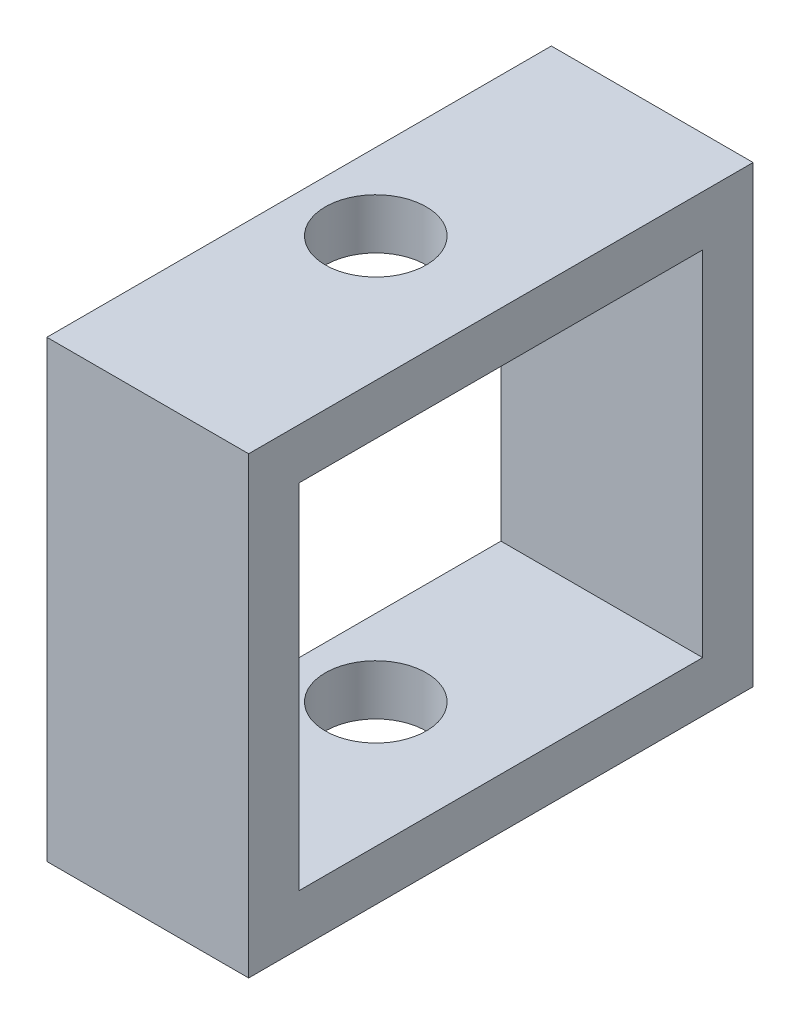
ISO-10303-21;
HEADER;
FILE_DESCRIPTION(('STEP AP214'),'2;1');
FILE_NAME('part.step','',(''),(''),'','','');
FILE_SCHEMA(('AUTOMOTIVE_DESIGN { 1 0 10303 214 1 1 1 1 }'));
ENDSEC;
DATA;
#1=APPLICATION_CONTEXT('core data for automotive mechanical design processes');
#2=APPLICATION_PROTOCOL_DEFINITION('international standard','automotive_design',2000,#1);
#3=PRODUCT_CONTEXT('',#1,'mechanical');
#4=PRODUCT('Part','Part','',(#3));
#5=PRODUCT_RELATED_PRODUCT_CATEGORY('part','',(#4));
#6=PRODUCT_DEFINITION_FORMATION('','',#4);
#7=PRODUCT_DEFINITION_CONTEXT('part definition',#1,'design');
#8=PRODUCT_DEFINITION('design','',#6,#7);
#9=PRODUCT_DEFINITION_SHAPE('','',#8);
#10=(LENGTH_UNIT() NAMED_UNIT(*) SI_UNIT(.MILLI.,.METRE.));
#11=(NAMED_UNIT(*) PLANE_ANGLE_UNIT() SI_UNIT($,.RADIAN.));
#12=(NAMED_UNIT(*) SI_UNIT($,.STERADIAN.) SOLID_ANGLE_UNIT());
#13=UNCERTAINTY_MEASURE_WITH_UNIT(LENGTH_MEASURE(1.E-05),#10,'distance_accuracy_value','');
#14=(GEOMETRIC_REPRESENTATION_CONTEXT(3) GLOBAL_UNCERTAINTY_ASSIGNED_CONTEXT((#13)) GLOBAL_UNIT_ASSIGNED_CONTEXT((#10,
#11,#12)) REPRESENTATION_CONTEXT('',''));
#15=CARTESIAN_POINT('',(0.,0.,0.));
#16=DIRECTION('',(0.,0.,1.));
#17=DIRECTION('',(1.,0.,0.));
#18=AXIS2_PLACEMENT_3D('',#15,#16,#17);
#19=CARTESIAN_POINT('',(0.,3.175,0.));
#20=DIRECTION('',(0.,-1.,0.));
#21=DIRECTION('',(0.,0.,-1.));
#22=AXIS2_PLACEMENT_3D('',#19,#20,#21);
#23=PLANE('',#22);
#24=CARTESIAN_POINT('',(4.826,3.175,-15.875));
#25=DIRECTION('',(0.,1.,0.));
#26=DIRECTION('',(0.,0.,1.));
#27=AXIS2_PLACEMENT_3D('',#24,#25,#26);
#28=CIRCLE('',#27,3.175);
#29=CARTESIAN_POINT('',(4.826,3.175,-12.7));
#30=VERTEX_POINT('',#29);
#31=EDGE_CURVE('E160',#30,#30,#28,.T.);
#32=ORIENTED_EDGE('',*,*,#31,.F.);
#33=EDGE_LOOP('',(#32));
#34=FACE_BOUND('',#33,.T.);
#35=DIRECTION('',(0.,0.,1.));
#36=VECTOR('',#35,1.);
#37=CARTESIAN_POINT('',(0.,3.175,0.));
#38=LINE('',#37,#36);
#39=CARTESIAN_POINT('',(0.,3.175,-28.575));
#40=VERTEX_POINT('',#39);
#41=CARTESIAN_POINT('',(0.,3.175,-3.175));
#42=VERTEX_POINT('',#41);
#43=EDGE_CURVE('E52',#40,#42,#38,.T.);
#44=ORIENTED_EDGE('',*,*,#43,.T.);
#45=DIRECTION('',(1.,0.,0.));
#46=VECTOR('',#45,1.);
#47=CARTESIAN_POINT('',(0.,3.175,-3.175));
#48=LINE('',#47,#46);
#49=CARTESIAN_POINT('',(12.7,3.175,-3.175));
#50=VERTEX_POINT('',#49);
#51=EDGE_CURVE('E134',#42,#50,#48,.T.);
#52=ORIENTED_EDGE('',*,*,#51,.T.);
#53=DIRECTION('',(0.,0.,-1.));
#54=VECTOR('',#53,1.);
#55=CARTESIAN_POINT('',(12.7,3.175,0.));
#56=LINE('',#55,#54);
#57=CARTESIAN_POINT('',(12.7,3.175,-28.575));
#58=VERTEX_POINT('',#57);
#59=EDGE_CURVE('E167',#50,#58,#56,.T.);
#60=ORIENTED_EDGE('',*,*,#59,.T.);
#61=DIRECTION('',(1.,0.,0.));
#62=VECTOR('',#61,1.);
#63=CARTESIAN_POINT('',(0.,3.175,-28.575));
#64=LINE('',#63,#62);
#65=EDGE_CURVE('E57',#40,#58,#64,.T.);
#66=ORIENTED_EDGE('',*,*,#65,.F.);
#67=EDGE_LOOP('',(#44,#52,#60,#66));
#68=FACE_BOUND('',#67,.T.);
#69=ADVANCED_FACE('F37',(#34,#68),#23,.F.);
#70=CARTESIAN_POINT('',(0.,0.,0.));
#71=DIRECTION('',(0.,-1.,0.));
#72=DIRECTION('',(0.,0.,-1.));
#73=AXIS2_PLACEMENT_3D('',#70,#71,#72);
#74=PLANE('',#73);
#75=DIRECTION('',(0.,0.,1.));
#76=VECTOR('',#75,1.);
#77=CARTESIAN_POINT('',(0.,0.,0.));
#78=LINE('',#77,#76);
#79=CARTESIAN_POINT('',(0.,0.,-31.75));
#80=VERTEX_POINT('',#79);
#81=CARTESIAN_POINT('',(0.,0.,0.));
#82=VERTEX_POINT('',#81);
#83=EDGE_CURVE('E163',#80,#82,#78,.T.);
#84=ORIENTED_EDGE('',*,*,#83,.F.);
#85=DIRECTION('',(-1.,0.,0.));
#86=VECTOR('',#85,1.);
#87=CARTESIAN_POINT('',(0.,0.,-31.75));
#88=LINE('',#87,#86);
#89=CARTESIAN_POINT('',(12.7,0.,-31.75));
#90=VERTEX_POINT('',#89);
#91=EDGE_CURVE('E168',#90,#80,#88,.T.);
#92=ORIENTED_EDGE('',*,*,#91,.F.);
#93=DIRECTION('',(0.,0.,-1.));
#94=VECTOR('',#93,1.);
#95=CARTESIAN_POINT('',(12.7,0.,0.));
#96=LINE('',#95,#94);
#97=CARTESIAN_POINT('',(12.7,0.,0.));
#98=VERTEX_POINT('',#97);
#99=EDGE_CURVE('E109',#98,#90,#96,.T.);
#100=ORIENTED_EDGE('',*,*,#99,.F.);
#101=DIRECTION('',(1.,0.,0.));
#102=VECTOR('',#101,1.);
#103=CARTESIAN_POINT('',(0.,0.,0.));
#104=LINE('',#103,#102);
#105=EDGE_CURVE('E172',#82,#98,#104,.T.);
#106=ORIENTED_EDGE('',*,*,#105,.F.);
#107=EDGE_LOOP('',(#84,#92,#100,#106));
#108=FACE_BOUND('',#107,.T.);
#109=CARTESIAN_POINT('',(4.826,0.,-15.875));
#110=DIRECTION('',(0.,1.,0.));
#111=DIRECTION('',(0.,0.,1.));
#112=AXIS2_PLACEMENT_3D('',#109,#110,#111);
#113=CIRCLE('',#112,3.175);
#114=CARTESIAN_POINT('',(4.826,0.,-12.7));
#115=VERTEX_POINT('',#114);
#116=EDGE_CURVE('E159',#115,#115,#113,.T.);
#117=ORIENTED_EDGE('',*,*,#116,.T.);
#118=EDGE_LOOP('',(#117));
#119=FACE_BOUND('',#118,.T.);
#120=ADVANCED_FACE('F179',(#108,#119),#74,.T.);
#121=CARTESIAN_POINT('',(0.,3.175,0.));
#122=DIRECTION('',(1.,0.,0.));
#123=DIRECTION('',(0.,0.,-1.));
#124=AXIS2_PLACEMENT_3D('',#121,#122,#123);
#125=PLANE('',#124);
#126=DIRECTION('',(0.,-1.,0.));
#127=VECTOR('',#126,1.);
#128=CARTESIAN_POINT('',(0.,25.4,-28.575));
#129=LINE('',#128,#127);
#130=CARTESIAN_POINT('',(0.,25.4,-28.575));
#131=VERTEX_POINT('',#130);
#132=EDGE_CURVE('E156',#131,#40,#129,.T.);
#133=ORIENTED_EDGE('',*,*,#132,.F.);
#134=DIRECTION('',(0.,0.,1.));
#135=VECTOR('',#134,1.);
#136=CARTESIAN_POINT('',(0.,25.4,-3.175));
#137=LINE('',#136,#135);
#138=CARTESIAN_POINT('',(0.,25.4,-3.175));
#139=VERTEX_POINT('',#138);
#140=EDGE_CURVE('E135',#131,#139,#137,.T.);
#141=ORIENTED_EDGE('',*,*,#140,.T.);
#142=DIRECTION('',(0.,-1.,0.));
#143=VECTOR('',#142,1.);
#144=CARTESIAN_POINT('',(0.,25.4,-3.175));
#145=LINE('',#144,#143);
#146=EDGE_CURVE('E147',#139,#42,#145,.T.);
#147=ORIENTED_EDGE('',*,*,#146,.T.);
#148=ORIENTED_EDGE('',*,*,#43,.F.);
#149=EDGE_LOOP('',(#133,#141,#147,#148));
#150=FACE_BOUND('',#149,.T.);
#151=ORIENTED_EDGE('',*,*,#83,.T.);
#152=DIRECTION('',(0.,-1.,0.));
#153=VECTOR('',#152,1.);
#154=CARTESIAN_POINT('',(0.,3.175,0.));
#155=LINE('',#154,#153);
#156=CARTESIAN_POINT('',(0.,28.575,0.));
#157=VERTEX_POINT('',#156);
#158=EDGE_CURVE('E11',#157,#82,#155,.T.);
#159=ORIENTED_EDGE('',*,*,#158,.F.);
#160=DIRECTION('',(0.,0.,1.));
#161=VECTOR('',#160,1.);
#162=CARTESIAN_POINT('',(0.,28.575,-31.75));
#163=LINE('',#162,#161);
#164=CARTESIAN_POINT('',(0.,28.575,-31.75));
#165=VERTEX_POINT('',#164);
#166=EDGE_CURVE('E128',#165,#157,#163,.T.);
#167=ORIENTED_EDGE('',*,*,#166,.F.);
#168=DIRECTION('',(0.,-1.,0.));
#169=VECTOR('',#168,1.);
#170=CARTESIAN_POINT('',(0.,3.175,-31.75));
#171=LINE('',#170,#169);
#172=EDGE_CURVE('E113',#165,#80,#171,.T.);
#173=ORIENTED_EDGE('',*,*,#172,.T.);
#174=EDGE_LOOP('',(#151,#159,#167,#173));
#175=FACE_BOUND('',#174,.T.);
#176=ADVANCED_FACE('F39',(#150,#175),#125,.F.);
#177=CARTESIAN_POINT('',(0.,3.175,0.));
#178=DIRECTION('',(0.,0.,-1.));
#179=DIRECTION('',(-1.,0.,0.));
#180=AXIS2_PLACEMENT_3D('',#177,#178,#179);
#181=PLANE('',#180);
#182=ORIENTED_EDGE('',*,*,#105,.T.);
#183=DIRECTION('',(0.,-1.,0.));
#184=VECTOR('',#183,1.);
#185=CARTESIAN_POINT('',(12.7,3.175,0.));
#186=LINE('',#185,#184);
#187=CARTESIAN_POINT('',(12.7,28.575,0.));
#188=VERTEX_POINT('',#187);
#189=EDGE_CURVE('E45',#188,#98,#186,.T.);
#190=ORIENTED_EDGE('',*,*,#189,.F.);
#191=DIRECTION('',(1.,0.,0.));
#192=VECTOR('',#191,1.);
#193=CARTESIAN_POINT('',(0.,28.575,0.));
#194=LINE('',#193,#192);
#195=EDGE_CURVE('E123',#157,#188,#194,.T.);
#196=ORIENTED_EDGE('',*,*,#195,.F.);
#197=ORIENTED_EDGE('',*,*,#158,.T.);
#198=EDGE_LOOP('',(#182,#190,#196,#197));
#199=FACE_BOUND('',#198,.T.);
#200=ADVANCED_FACE('F182',(#199),#181,.F.);
#201=CARTESIAN_POINT('',(12.7,3.175,0.));
#202=DIRECTION('',(-1.,0.,0.));
#203=DIRECTION('',(0.,0.,1.));
#204=AXIS2_PLACEMENT_3D('',#201,#202,#203);
#205=PLANE('',#204);
#206=DIRECTION('',(0.,-1.,0.));
#207=VECTOR('',#206,1.);
#208=CARTESIAN_POINT('',(12.7,3.175,-31.75));
#209=LINE('',#208,#207);
#210=CARTESIAN_POINT('',(12.7,28.575,-31.75));
#211=VERTEX_POINT('',#210);
#212=EDGE_CURVE('E101',#211,#90,#209,.T.);
#213=ORIENTED_EDGE('',*,*,#212,.F.);
#214=DIRECTION('',(0.,0.,-1.));
#215=VECTOR('',#214,1.);
#216=CARTESIAN_POINT('',(12.7,28.575,-3.175));
#217=LINE('',#216,#215);
#218=EDGE_CURVE('E106',#188,#211,#217,.T.);
#219=ORIENTED_EDGE('',*,*,#218,.F.);
#220=ORIENTED_EDGE('',*,*,#189,.T.);
#221=ORIENTED_EDGE('',*,*,#99,.T.);
#222=EDGE_LOOP('',(#213,#219,#220,#221));
#223=FACE_BOUND('',#222,.T.);
#224=DIRECTION('',(0.,0.,-1.));
#225=VECTOR('',#224,1.);
#226=CARTESIAN_POINT('',(12.7,25.4,0.));
#227=LINE('',#226,#225);
#228=CARTESIAN_POINT('',(12.7,25.4,-3.175));
#229=VERTEX_POINT('',#228);
#230=CARTESIAN_POINT('',(12.7,25.4,-28.575));
#231=VERTEX_POINT('',#230);
#232=EDGE_CURVE('E124',#229,#231,#227,.T.);
#233=ORIENTED_EDGE('',*,*,#232,.T.);
#234=DIRECTION('',(0.,-1.,0.));
#235=VECTOR('',#234,1.);
#236=CARTESIAN_POINT('',(12.7,25.4,-28.575));
#237=LINE('',#236,#235);
#238=EDGE_CURVE('E152',#231,#58,#237,.T.);
#239=ORIENTED_EDGE('',*,*,#238,.T.);
#240=ORIENTED_EDGE('',*,*,#59,.F.);
#241=DIRECTION('',(0.,-1.,0.));
#242=VECTOR('',#241,1.);
#243=CARTESIAN_POINT('',(12.7,25.4,-3.175));
#244=LINE('',#243,#242);
#245=EDGE_CURVE('E143',#229,#50,#244,.T.);
#246=ORIENTED_EDGE('',*,*,#245,.F.);
#247=EDGE_LOOP('',(#233,#239,#240,#246));
#248=FACE_BOUND('',#247,.T.);
#249=ADVANCED_FACE('F103',(#223,#248),#205,.F.);
#250=CARTESIAN_POINT('',(0.,3.175,-31.75));
#251=DIRECTION('',(0.,0.,1.));
#252=DIRECTION('',(1.,0.,0.));
#253=AXIS2_PLACEMENT_3D('',#250,#251,#252);
#254=PLANE('',#253);
#255=ORIENTED_EDGE('',*,*,#91,.T.);
#256=ORIENTED_EDGE('',*,*,#172,.F.);
#257=DIRECTION('',(-1.,0.,0.));
#258=VECTOR('',#257,1.);
#259=CARTESIAN_POINT('',(12.7,28.575,-31.75));
#260=LINE('',#259,#258);
#261=EDGE_CURVE('E120',#211,#165,#260,.T.);
#262=ORIENTED_EDGE('',*,*,#261,.F.);
#263=ORIENTED_EDGE('',*,*,#212,.T.);
#264=EDGE_LOOP('',(#255,#256,#262,#263));
#265=FACE_BOUND('',#264,.T.);
#266=ADVANCED_FACE('F126',(#265),#254,.F.);
#267=CARTESIAN_POINT('',(4.826,3.175,-15.875));
#268=DIRECTION('',(0.,-1.,0.));
#269=DIRECTION('',(0.,0.,-1.));
#270=AXIS2_PLACEMENT_3D('',#267,#268,#269);
#271=CYLINDRICAL_SURFACE('',#270,3.175);
#272=ORIENTED_EDGE('',*,*,#31,.T.);
#273=EDGE_LOOP('',(#272));
#274=FACE_BOUND('',#273,.T.);
#275=ORIENTED_EDGE('',*,*,#116,.F.);
#276=EDGE_LOOP('',(#275));
#277=FACE_BOUND('',#276,.T.);
#278=ADVANCED_FACE('F199',(#274,#277),#271,.F.);
#279=CARTESIAN_POINT('',(0.,25.4,-28.575));
#280=DIRECTION('',(0.,0.,-1.));
#281=DIRECTION('',(-1.,0.,0.));
#282=AXIS2_PLACEMENT_3D('',#279,#280,#281);
#283=PLANE('',#282);
#284=ORIENTED_EDGE('',*,*,#65,.T.);
#285=ORIENTED_EDGE('',*,*,#238,.F.);
#286=DIRECTION('',(1.,0.,0.));
#287=VECTOR('',#286,1.);
#288=CARTESIAN_POINT('',(0.,25.4,-28.575));
#289=LINE('',#288,#287);
#290=EDGE_CURVE('E149',#131,#231,#289,.T.);
#291=ORIENTED_EDGE('',*,*,#290,.F.);
#292=ORIENTED_EDGE('',*,*,#132,.T.);
#293=EDGE_LOOP('',(#284,#285,#291,#292));
#294=FACE_BOUND('',#293,.T.);
#295=ADVANCED_FACE('F206',(#294),#283,.F.);
#296=CARTESIAN_POINT('',(0.,25.4,-3.175));
#297=DIRECTION('',(0.,0.,-1.));
#298=DIRECTION('',(-1.,0.,0.));
#299=AXIS2_PLACEMENT_3D('',#296,#297,#298);
#300=PLANE('',#299);
#301=ORIENTED_EDGE('',*,*,#51,.F.);
#302=ORIENTED_EDGE('',*,*,#146,.F.);
#303=DIRECTION('',(1.,0.,0.));
#304=VECTOR('',#303,1.);
#305=CARTESIAN_POINT('',(0.,25.4,-3.175));
#306=LINE('',#305,#304);
#307=EDGE_CURVE('E141',#139,#229,#306,.T.);
#308=ORIENTED_EDGE('',*,*,#307,.T.);
#309=ORIENTED_EDGE('',*,*,#245,.T.);
#310=EDGE_LOOP('',(#301,#302,#308,#309));
#311=FACE_BOUND('',#310,.T.);
#312=ADVANCED_FACE('F211',(#311),#300,.T.);
#313=CARTESIAN_POINT('',(0.,25.4,0.));
#314=DIRECTION('',(0.,1.,0.));
#315=DIRECTION('',(0.,0.,1.));
#316=AXIS2_PLACEMENT_3D('',#313,#314,#315);
#317=PLANE('',#316);
#318=CARTESIAN_POINT('',(4.826,25.4,-15.875));
#319=DIRECTION('',(0.,1.,0.));
#320=DIRECTION('',(0.,0.,1.));
#321=AXIS2_PLACEMENT_3D('',#318,#319,#320);
#322=CIRCLE('',#321,3.175);
#323=CARTESIAN_POINT('',(4.826,25.4,-12.7));
#324=VERTEX_POINT('',#323);
#325=EDGE_CURVE('E237',#324,#324,#322,.T.);
#326=ORIENTED_EDGE('',*,*,#325,.T.);
#327=EDGE_LOOP('',(#326));
#328=FACE_BOUND('',#327,.T.);
#329=ORIENTED_EDGE('',*,*,#140,.F.);
#330=ORIENTED_EDGE('',*,*,#290,.T.);
#331=ORIENTED_EDGE('',*,*,#232,.F.);
#332=ORIENTED_EDGE('',*,*,#307,.F.);
#333=EDGE_LOOP('',(#329,#330,#331,#332));
#334=FACE_BOUND('',#333,.T.);
#335=ADVANCED_FACE('F218',(#328,#334),#317,.F.);
#336=CARTESIAN_POINT('',(0.,28.575,0.));
#337=DIRECTION('',(0.,1.,0.));
#338=DIRECTION('',(0.,0.,1.));
#339=AXIS2_PLACEMENT_3D('',#336,#337,#338);
#340=PLANE('',#339);
#341=ORIENTED_EDGE('',*,*,#218,.T.);
#342=ORIENTED_EDGE('',*,*,#261,.T.);
#343=ORIENTED_EDGE('',*,*,#166,.T.);
#344=ORIENTED_EDGE('',*,*,#195,.T.);
#345=EDGE_LOOP('',(#341,#342,#343,#344));
#346=FACE_BOUND('',#345,.T.);
#347=CARTESIAN_POINT('',(4.826,28.575,-15.875));
#348=DIRECTION('',(0.,1.,0.));
#349=DIRECTION('',(0.,0.,1.));
#350=AXIS2_PLACEMENT_3D('',#347,#348,#349);
#351=CIRCLE('',#350,3.175);
#352=CARTESIAN_POINT('',(4.826,28.575,-12.7));
#353=VERTEX_POINT('',#352);
#354=EDGE_CURVE('E138',#353,#353,#351,.T.);
#355=ORIENTED_EDGE('',*,*,#354,.F.);
#356=EDGE_LOOP('',(#355));
#357=FACE_BOUND('',#356,.T.);
#358=ADVANCED_FACE('F117',(#346,#357),#340,.T.);
#359=CARTESIAN_POINT('',(4.826,28.575,-15.875));
#360=DIRECTION('',(0.,-1.,0.));
#361=DIRECTION('',(0.,0.,-1.));
#362=AXIS2_PLACEMENT_3D('',#359,#360,#361);
#363=CYLINDRICAL_SURFACE('',#362,3.175);
#364=ORIENTED_EDGE('',*,*,#354,.T.);
#365=EDGE_LOOP('',(#364));
#366=FACE_BOUND('',#365,.T.);
#367=ORIENTED_EDGE('',*,*,#325,.F.);
#368=EDGE_LOOP('',(#367));
#369=FACE_BOUND('',#368,.T.);
#370=ADVANCED_FACE('F227',(#366,#369),#363,.F.);
#371=CLOSED_SHELL('',(#69,#120,#176,#200,#249,#266,#278,#295,#312,#335,#358,#370));
#372=MANIFOLD_SOLID_BREP('B2',#371);
#373=ADVANCED_BREP_SHAPE_REPRESENTATION('',(#18,#372),#14);
#374=SHAPE_DEFINITION_REPRESENTATION(#9,#373);
ENDSEC;
END-ISO-10303-21;
